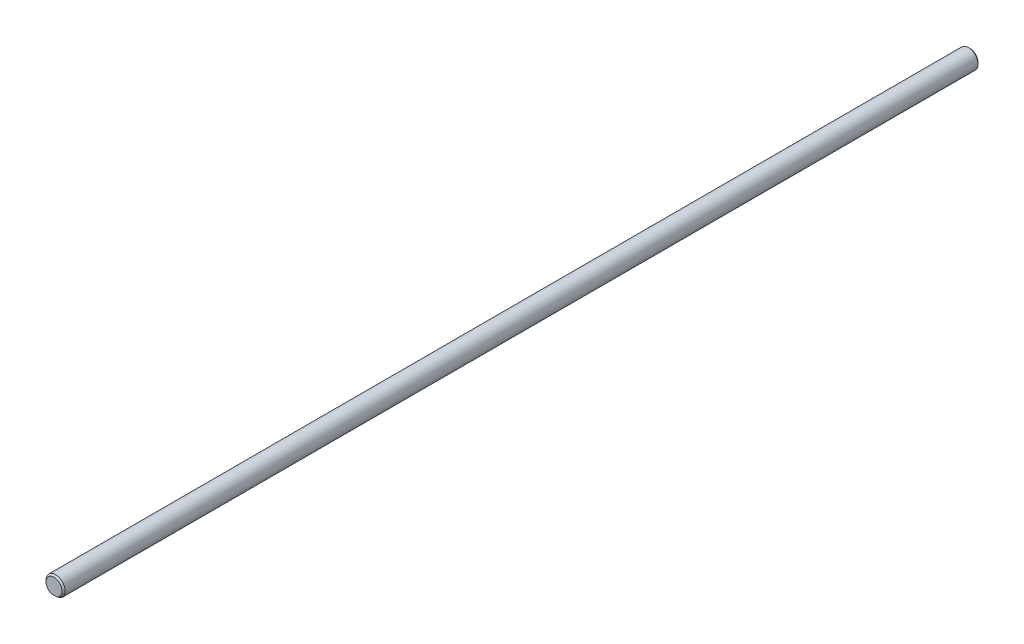
ISO-10303-21;
HEADER;
FILE_DESCRIPTION(('STEP AP214'),'2;1');
FILE_NAME('part.step','',(''),(''),'','','');
FILE_SCHEMA(('AUTOMOTIVE_DESIGN { 1 0 10303 214 1 1 1 1 }'));
ENDSEC;
DATA;
#1=APPLICATION_CONTEXT('core data for automotive mechanical design processes');
#2=APPLICATION_PROTOCOL_DEFINITION('international standard','automotive_design',2000,#1);
#3=PRODUCT_CONTEXT('',#1,'mechanical');
#4=PRODUCT('Part','Part','',(#3));
#5=PRODUCT_RELATED_PRODUCT_CATEGORY('part','',(#4));
#6=PRODUCT_DEFINITION_FORMATION('','',#4);
#7=PRODUCT_DEFINITION_CONTEXT('part definition',#1,'design');
#8=PRODUCT_DEFINITION('design','',#6,#7);
#9=PRODUCT_DEFINITION_SHAPE('','',#8);
#10=(LENGTH_UNIT() NAMED_UNIT(*) SI_UNIT(.MILLI.,.METRE.));
#11=(NAMED_UNIT(*) PLANE_ANGLE_UNIT() SI_UNIT($,.RADIAN.));
#12=(NAMED_UNIT(*) SI_UNIT($,.STERADIAN.) SOLID_ANGLE_UNIT());
#13=UNCERTAINTY_MEASURE_WITH_UNIT(LENGTH_MEASURE(1.E-05),#10,'distance_accuracy_value','');
#14=(GEOMETRIC_REPRESENTATION_CONTEXT(3) GLOBAL_UNCERTAINTY_ASSIGNED_CONTEXT((#13)) GLOBAL_UNIT_ASSIGNED_CONTEXT((#10,
#11,#12)) REPRESENTATION_CONTEXT('',''));
#15=CARTESIAN_POINT('',(0.,0.,0.));
#16=DIRECTION('',(0.,0.,1.));
#17=DIRECTION('',(1.,0.,0.));
#18=AXIS2_PLACEMENT_3D('',#15,#16,#17);
#19=CARTESIAN_POINT('',(0.,0.,-152.4));
#20=DIRECTION('',(0.,0.,-1.));
#21=DIRECTION('',(-1.,0.,0.));
#22=AXIS2_PLACEMENT_3D('',#19,#20,#21);
#23=PLANE('',#22);
#24=DIRECTION('',(1.,0.,0.));
#25=VECTOR('',#24,1.);
#26=CARTESIAN_POINT('',(-1.90500000000003,-2.54,-152.4));
#27=LINE('',#26,#25);
#28=CARTESIAN_POINT('',(-0.839061976256794,-2.54,-152.4));
#29=VERTEX_POINT('',#28);
#30=CARTESIAN_POINT('',(0.839061976256738,-2.54,-152.4));
#31=VERTEX_POINT('',#30);
#32=EDGE_CURVE('E102',#29,#31,#27,.T.);
#33=ORIENTED_EDGE('',*,*,#32,.F.);
#34=CARTESIAN_POINT('',(0.,0.,-152.4));
#35=DIRECTION('',(0.,0.,-1.));
#36=DIRECTION('',(-1.,0.,0.));
#37=AXIS2_PLACEMENT_3D('',#34,#35,#36);
#38=CIRCLE('',#37,2.67499999999998);
#39=EDGE_CURVE('E47',#29,#31,#38,.T.);
#40=ORIENTED_EDGE('',*,*,#39,.T.);
#41=EDGE_LOOP('',(#33,#40));
#42=FACE_BOUND('',#41,.T.);
#43=ADVANCED_FACE('F37',(#42),#23,.T.);
#44=CARTESIAN_POINT('',(0.,0.,152.4));
#45=DIRECTION('',(0.,0.,-1.));
#46=DIRECTION('',(-1.,0.,0.));
#47=AXIS2_PLACEMENT_3D('',#44,#45,#46);
#48=PLANE('',#47);
#49=DIRECTION('',(1.,0.,0.));
#50=VECTOR('',#49,1.);
#51=CARTESIAN_POINT('',(-1.90499999999997,-2.54,152.4));
#52=LINE('',#51,#50);
#53=CARTESIAN_POINT('',(-0.839061976256827,-2.54,152.4));
#54=VERTEX_POINT('',#53);
#55=CARTESIAN_POINT('',(0.839061976256883,-2.54,152.4));
#56=VERTEX_POINT('',#55);
#57=EDGE_CURVE('E98',#54,#56,#52,.T.);
#58=ORIENTED_EDGE('',*,*,#57,.T.);
#59=CARTESIAN_POINT('',(0.,0.,152.4));
#60=DIRECTION('',(0.,0.,-1.));
#61=DIRECTION('',(-1.,0.,0.));
#62=AXIS2_PLACEMENT_3D('',#59,#60,#61);
#63=CIRCLE('',#62,2.67500000000001);
#64=EDGE_CURVE('E11',#56,#54,#63,.F.);
#65=ORIENTED_EDGE('',*,*,#64,.T.);
#66=EDGE_LOOP('',(#58,#65));
#67=FACE_BOUND('',#66,.T.);
#68=ADVANCED_FACE('F122',(#67),#48,.F.);
#69=CARTESIAN_POINT('',(0.,0.,-152.4));
#70=DIRECTION('',(0.,0.,1.));
#71=DIRECTION('',(1.,0.,0.));
#72=AXIS2_PLACEMENT_3D('',#69,#70,#71);
#73=CYLINDRICAL_SURFACE('',#72,3.175);
#74=DIRECTION('',(0.,0.,1.));
#75=VECTOR('',#74,1.);
#76=CARTESIAN_POINT('',(1.90499999999997,-2.54,-152.4));
#77=LINE('',#76,#75);
#78=CARTESIAN_POINT('',(1.90499999999997,-2.54,-151.9));
#79=VERTEX_POINT('',#78);
#80=CARTESIAN_POINT('',(1.90500000000003,-2.54,151.9));
#81=VERTEX_POINT('',#80);
#82=EDGE_CURVE('E91',#79,#81,#77,.T.);
#83=ORIENTED_EDGE('',*,*,#82,.F.);
#84=CARTESIAN_POINT('',(0.,0.,-151.9));
#85=DIRECTION('',(0.,0.,-1.));
#86=DIRECTION('',(-1.,0.,0.));
#87=AXIS2_PLACEMENT_3D('',#84,#85,#86);
#88=CIRCLE('',#87,3.175);
#89=CARTESIAN_POINT('',(-1.90500000000003,-2.54,-151.9));
#90=VERTEX_POINT('',#89);
#91=EDGE_CURVE('E81',#79,#90,#88,.F.);
#92=ORIENTED_EDGE('',*,*,#91,.T.);
#93=DIRECTION('',(0.,0.,1.));
#94=VECTOR('',#93,1.);
#95=CARTESIAN_POINT('',(-1.90500000000003,-2.54,-152.4));
#96=LINE('',#95,#94);
#97=CARTESIAN_POINT('',(-1.90499999999997,-2.54,151.9));
#98=VERTEX_POINT('',#97);
#99=EDGE_CURVE('E88',#90,#98,#96,.T.);
#100=ORIENTED_EDGE('',*,*,#99,.T.);
#101=CARTESIAN_POINT('',(0.,0.,151.9));
#102=DIRECTION('',(0.,0.,-1.));
#103=DIRECTION('',(-1.,0.,0.));
#104=AXIS2_PLACEMENT_3D('',#101,#102,#103);
#105=CIRCLE('',#104,3.175);
#106=EDGE_CURVE('E93',#98,#81,#105,.T.);
#107=ORIENTED_EDGE('',*,*,#106,.T.);
#108=EDGE_LOOP('',(#83,#92,#100,#107));
#109=FACE_BOUND('',#108,.T.);
#110=ADVANCED_FACE('F87',(#109),#73,.T.);
#111=CARTESIAN_POINT('',(-1.90500000000003,-2.54,-152.4));
#112=DIRECTION('',(0.,-1.,0.));
#113=DIRECTION('',(0.,0.,-1.));
#114=AXIS2_PLACEMENT_3D('',#111,#112,#113);
#115=PLANE('',#114);
#116=ORIENTED_EDGE('',*,*,#99,.F.);
#117=CARTESIAN_POINT('',(-1.90500000000003,-2.54,-151.9));
#118=CARTESIAN_POINT('',(-1.82057616384335,-2.54,-151.950612079058));
#119=CARTESIAN_POINT('',(-1.73520085655569,-2.54,-151.999722808161));
#120=CARTESIAN_POINT('',(-1.56255506901467,-2.54,-152.093743980208));
#121=CARTESIAN_POINT('',(-1.47529205702914,-2.54,-152.138668195303));
#122=CARTESIAN_POINT('',(-1.2982218414941,-2.54,-152.223518801737));
#123=CARTESIAN_POINT('',(-1.20841230086511,-2.54,-152.263440407052));
#124=CARTESIAN_POINT('',(-1.02588565435889,-2.54,-152.336921088513));
#125=CARTESIAN_POINT('',(-0.933159615756529,-2.54,-152.370457824066));
#126=CARTESIAN_POINT('',(-0.839061976256801,-2.54,-152.4));
#127=B_SPLINE_CURVE_WITH_KNOTS('',3,(#117,#118,#119,#120,#121,#122,#123,#124,#125,#126),
.UNSPECIFIED.,.F.,.F.,(4,2,2,2,4),(0.,0.295344631156659,0.589680590550513,0.884296027084837,
1.17992410070191),.UNSPECIFIED.);
#128=EDGE_CURVE('E59',#90,#29,#127,.T.);
#129=ORIENTED_EDGE('',*,*,#128,.T.);
#130=ORIENTED_EDGE('',*,*,#32,.T.);
#131=CARTESIAN_POINT('',(0.839061976256738,-2.54,-152.4));
#132=CARTESIAN_POINT('',(0.933159615756456,-2.54,-152.370457824066));
#133=CARTESIAN_POINT('',(1.02588565435882,-2.54,-152.336921088513));
#134=CARTESIAN_POINT('',(1.20841230086504,-2.54,-152.263440407052));
#135=CARTESIAN_POINT('',(1.29822184149403,-2.54,-152.223518801737));
#136=CARTESIAN_POINT('',(1.47529205702907,-2.54,-152.138668195303));
#137=CARTESIAN_POINT('',(1.56255506901461,-2.54,-152.093743980208));
#138=CARTESIAN_POINT('',(1.73520085655563,-2.54,-151.999722808161));
#139=CARTESIAN_POINT('',(1.82057616384328,-2.54,-151.950612079058));
#140=CARTESIAN_POINT('',(1.90499999999998,-2.54,-151.9));
#141=B_SPLINE_CURVE_WITH_KNOTS('',3,(#131,#132,#133,#134,#135,#136,#137,#138,#139,#140),
.UNSPECIFIED.,.F.,.F.,(4,2,2,2,4),(0.,0.295628073617071,0.590243510151386,0.884579469545255,
1.17992410070193),.UNSPECIFIED.);
#142=EDGE_CURVE('E82',#31,#79,#141,.T.);
#143=ORIENTED_EDGE('',*,*,#142,.T.);
#144=ORIENTED_EDGE('',*,*,#82,.T.);
#145=CARTESIAN_POINT('',(1.90500000000003,-2.54,151.9));
#146=CARTESIAN_POINT('',(1.82057616384335,-2.54,151.950612079058));
#147=CARTESIAN_POINT('',(1.7352008565557,-2.54,151.999722808161));
#148=CARTESIAN_POINT('',(1.5625550690147,-2.54,152.093743980208));
#149=CARTESIAN_POINT('',(1.47529205702917,-2.54,152.138668195303));
#150=CARTESIAN_POINT('',(1.29822184149415,-2.54,152.223518801737));
#151=CARTESIAN_POINT('',(1.20841230086516,-2.54,152.263440407052));
#152=CARTESIAN_POINT('',(1.02588565435896,-2.54,152.336921088513));
#153=CARTESIAN_POINT('',(0.933159615756604,-2.54,152.370457824066));
#154=CARTESIAN_POINT('',(0.839061976256893,-2.54,152.4));
#155=B_SPLINE_CURVE_WITH_KNOTS('',3,(#145,#146,#147,#148,#149,#150,#151,#152,#153,#154),
.UNSPECIFIED.,.F.,.F.,(4,2,2,2,4),(0.,0.295344631156648,0.589680590550478,0.884296027084773,
1.17992410070182),.UNSPECIFIED.);
#156=EDGE_CURVE('E92',#81,#56,#155,.T.);
#157=ORIENTED_EDGE('',*,*,#156,.T.);
#158=ORIENTED_EDGE('',*,*,#57,.F.);
#159=CARTESIAN_POINT('',(-0.839061976256827,-2.54,152.4));
#160=CARTESIAN_POINT('',(-0.93315961575654,-2.54,152.370457824066));
#161=CARTESIAN_POINT('',(-1.02588565435889,-2.54,152.336921088513));
#162=CARTESIAN_POINT('',(-1.2084123008651,-2.54,152.263440407052));
#163=CARTESIAN_POINT('',(-1.29822184149409,-2.54,152.223518801737));
#164=CARTESIAN_POINT('',(-1.47529205702911,-2.54,152.138668195303));
#165=CARTESIAN_POINT('',(-1.56255506901464,-2.54,152.093743980208));
#166=CARTESIAN_POINT('',(-1.73520085655565,-2.54,151.999722808161));
#167=CARTESIAN_POINT('',(-1.82057616384329,-2.54,151.950612079058));
#168=CARTESIAN_POINT('',(-1.90499999999998,-2.54,151.9));
#169=B_SPLINE_CURVE_WITH_KNOTS('',3,(#159,#160,#161,#162,#163,#164,#165,#166,#167,#168),
.UNSPECIFIED.,.F.,.F.,(4,2,2,2,4),(0.,0.295628073617052,0.590243510151349,0.884579469545182,
1.17992410070183),.UNSPECIFIED.);
#170=EDGE_CURVE('E97',#54,#98,#169,.T.);
#171=ORIENTED_EDGE('',*,*,#170,.T.);
#172=EDGE_LOOP('',(#116,#129,#130,#143,#144,#157,#158,#171));
#173=FACE_BOUND('',#172,.T.);
#174=ADVANCED_FACE('F95',(#173),#115,.T.);
#175=CARTESIAN_POINT('',(0.,0.,-151.9));
#176=DIRECTION('',(0.,0.,1.));
#177=DIRECTION('',(1.,0.,0.));
#178=AXIS2_PLACEMENT_3D('',#175,#176,#177);
#179=CONICAL_SURFACE('',#178,3.175,0.785398163397438);
#180=ORIENTED_EDGE('',*,*,#142,.F.);
#181=ORIENTED_EDGE('',*,*,#39,.F.);
#182=ORIENTED_EDGE('',*,*,#128,.F.);
#183=ORIENTED_EDGE('',*,*,#91,.F.);
#184=EDGE_LOOP('',(#180,#181,#182,#183));
#185=FACE_BOUND('',#184,.T.);
#186=ADVANCED_FACE('F80',(#185),#179,.T.);
#187=CARTESIAN_POINT('',(0.,0.,152.4));
#188=DIRECTION('',(0.,0.,-1.));
#189=DIRECTION('',(-1.,0.,0.));
#190=AXIS2_PLACEMENT_3D('',#187,#188,#189);
#191=CONICAL_SURFACE('',#190,2.67500000000001,0.785398163397438);
#192=ORIENTED_EDGE('',*,*,#156,.F.);
#193=ORIENTED_EDGE('',*,*,#106,.F.);
#194=ORIENTED_EDGE('',*,*,#170,.F.);
#195=ORIENTED_EDGE('',*,*,#64,.F.);
#196=EDGE_LOOP('',(#192,#193,#194,#195));
#197=FACE_BOUND('',#196,.T.);
#198=ADVANCED_FACE('F40',(#197),#191,.T.);
#199=CLOSED_SHELL('',(#43,#68,#110,#174,#186,#198));
#200=MANIFOLD_SOLID_BREP('B2',#199);
#201=ADVANCED_BREP_SHAPE_REPRESENTATION('',(#18,#200),#14);
#202=SHAPE_DEFINITION_REPRESENTATION(#9,#201);
ENDSEC;
END-ISO-10303-21;
